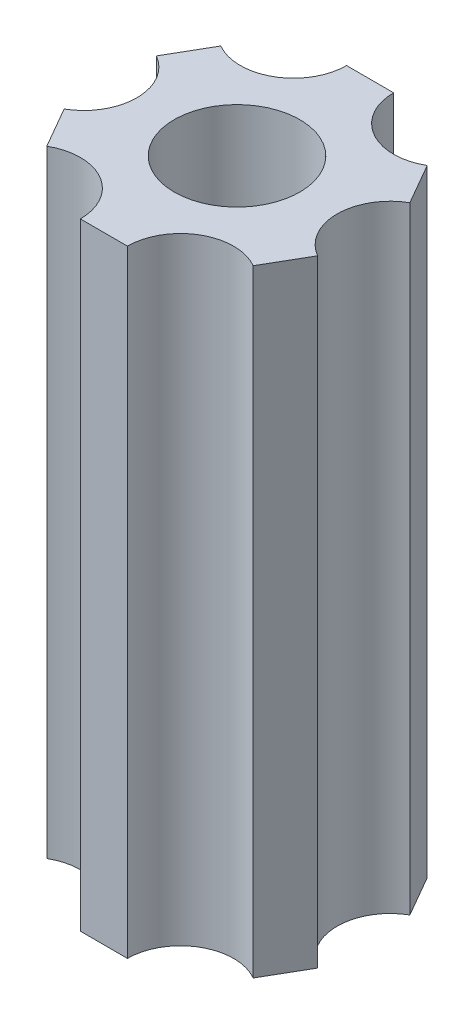
ISO-10303-21;
HEADER;
FILE_DESCRIPTION(('STEP AP214'),'2;1');
FILE_NAME('part.step','',(''),(''),'','','');
FILE_SCHEMA(('AUTOMOTIVE_DESIGN { 1 0 10303 214 1 1 1 1 }'));
ENDSEC;
DATA;
#1=APPLICATION_CONTEXT('core data for automotive mechanical design processes');
#2=APPLICATION_PROTOCOL_DEFINITION('international standard','automotive_design',2000,#1);
#3=PRODUCT_CONTEXT('',#1,'mechanical');
#4=PRODUCT('Part','Part','',(#3));
#5=PRODUCT_RELATED_PRODUCT_CATEGORY('part','',(#4));
#6=PRODUCT_DEFINITION_FORMATION('','',#4);
#7=PRODUCT_DEFINITION_CONTEXT('part definition',#1,'design');
#8=PRODUCT_DEFINITION('design','',#6,#7);
#9=PRODUCT_DEFINITION_SHAPE('','',#8);
#10=(LENGTH_UNIT() NAMED_UNIT(*) SI_UNIT(.MILLI.,.METRE.));
#11=(NAMED_UNIT(*) PLANE_ANGLE_UNIT() SI_UNIT($,.RADIAN.));
#12=(NAMED_UNIT(*) SI_UNIT($,.STERADIAN.) SOLID_ANGLE_UNIT());
#13=UNCERTAINTY_MEASURE_WITH_UNIT(LENGTH_MEASURE(1.E-05),#10,'distance_accuracy_value','');
#14=(GEOMETRIC_REPRESENTATION_CONTEXT(3) GLOBAL_UNCERTAINTY_ASSIGNED_CONTEXT((#13)) GLOBAL_UNIT_ASSIGNED_CONTEXT((#10,
#11,#12)) REPRESENTATION_CONTEXT('',''));
#15=CARTESIAN_POINT('',(0.,0.,0.));
#16=DIRECTION('',(0.,0.,1.));
#17=DIRECTION('',(1.,0.,0.));
#18=AXIS2_PLACEMENT_3D('',#15,#16,#17);
#19=CARTESIAN_POINT('',(-7.33234134065727,29.464,-0.0101881017723039));
#20=DIRECTION('',(0.,-1.,0.));
#21=DIRECTION('',(0.,0.,-1.));
#22=AXIS2_PLACEMENT_3D('',#19,#20,#21);
#23=CYLINDRICAL_SURFACE('',#22,2.54000000000018);
#24=CARTESIAN_POINT('',(-7.33234134065727,0.,-0.0101881017723039));
#25=DIRECTION('',(0.,1.,0.));
#26=DIRECTION('',(0.,0.,1.));
#27=AXIS2_PLACEMENT_3D('',#24,#25,#26);
#28=CIRCLE('',#27,2.54000000000018);
#29=CARTESIAN_POINT('',(-6.0653989971434,0.,2.19127893141545));
#30=VERTEX_POINT('',#29);
#31=CARTESIAN_POINT('',(-6.05928613608006,0.,-2.20812587297962));
#32=VERTEX_POINT('',#31);
#33=EDGE_CURVE('E164',#30,#32,#28,.T.);
#34=ORIENTED_EDGE('',*,*,#33,.F.);
#35=DIRECTION('',(0.,-1.,0.));
#36=VECTOR('',#35,1.);
#37=CARTESIAN_POINT('',(-6.0653989971434,29.464,2.19127893141545));
#38=LINE('',#37,#36);
#39=CARTESIAN_POINT('',(-6.0653989971434,29.464,2.19127893141545));
#40=VERTEX_POINT('',#39);
#41=EDGE_CURVE('E11',#40,#30,#38,.T.);
#42=ORIENTED_EDGE('',*,*,#41,.F.);
#43=CARTESIAN_POINT('',(-7.33234134065727,29.464,-0.0101881017723039));
#44=DIRECTION('',(0.,1.,0.));
#45=DIRECTION('',(0.,0.,1.));
#46=AXIS2_PLACEMENT_3D('',#43,#44,#45);
#47=CIRCLE('',#46,2.54000000000018);
#48=CARTESIAN_POINT('',(-6.05928613608006,29.464,-2.20812587297962));
#49=VERTEX_POINT('',#48);
#50=EDGE_CURVE('E208',#40,#49,#47,.T.);
#51=ORIENTED_EDGE('',*,*,#50,.T.);
#52=DIRECTION('',(0.,-1.,0.));
#53=VECTOR('',#52,1.);
#54=CARTESIAN_POINT('',(-6.05928613608006,29.464,-2.20812587297962));
#55=LINE('',#54,#53);
#56=EDGE_CURVE('E105',#49,#32,#55,.T.);
#57=ORIENTED_EDGE('',*,*,#56,.T.);
#58=EDGE_LOOP('',(#34,#42,#51,#57));
#59=FACE_BOUND('',#58,.T.);
#60=ADVANCED_FACE('F41',(#59),#23,.F.);
#61=CARTESIAN_POINT('',(-5.5036675829688,29.464,3.16735585878479));
#62=DIRECTION('',(0.866719304404536,0.,-0.498796198233825));
#63=DIRECTION('',(-0.498796198233825,0.,-0.866719304404536));
#64=AXIS2_PLACEMENT_3D('',#61,#62,#63);
#65=PLANE('',#64);
#66=DIRECTION('',(0.498796198233825,0.,0.866719304404536));
#67=VECTOR('',#66,1.);
#68=CARTESIAN_POINT('',(-5.5036675829688,0.,3.16735585878479));
#69=LINE('',#68,#67);
#70=CARTESIAN_POINT('',(-4.94193616879407,0.,4.14343278615436));
#71=VERTEX_POINT('',#70);
#72=EDGE_CURVE('E168',#30,#71,#69,.T.);
#73=ORIENTED_EDGE('',*,*,#72,.T.);
#74=DIRECTION('',(0.,-1.,0.));
#75=VECTOR('',#74,1.);
#76=CARTESIAN_POINT('',(-4.94193616879407,29.464,4.14343278615436));
#77=LINE('',#76,#75);
#78=CARTESIAN_POINT('',(-4.94193616879407,29.464,4.14343278615436));
#79=VERTEX_POINT('',#78);
#80=EDGE_CURVE('E51',#79,#71,#77,.T.);
#81=ORIENTED_EDGE('',*,*,#80,.F.);
#82=DIRECTION('',(0.498796198233825,0.,0.866719304404536));
#83=VECTOR('',#82,1.);
#84=CARTESIAN_POINT('',(-5.5036675829688,29.464,3.16735585878479));
#85=LINE('',#84,#83);
#86=EDGE_CURVE('E259',#40,#79,#85,.T.);
#87=ORIENTED_EDGE('',*,*,#86,.F.);
#88=ORIENTED_EDGE('',*,*,#41,.T.);
#89=EDGE_LOOP('',(#73,#81,#87,#88));
#90=FACE_BOUND('',#89,.T.);
#91=ADVANCED_FACE('F243',(#90),#65,.F.);
#92=CARTESIAN_POINT('',(-3.67499382527952,29.464,6.34489981934205));
#93=DIRECTION('',(0.,-1.,0.));
#94=DIRECTION('',(0.,0.,-1.));
#95=AXIS2_PLACEMENT_3D('',#92,#93,#94);
#96=CYLINDRICAL_SURFACE('',#95,2.54000000000046);
#97=CARTESIAN_POINT('',(-3.67499382527952,0.,6.34489981934205));
#98=DIRECTION('',(0.,1.,0.));
#99=DIRECTION('',(0.,0.,1.));
#100=AXIS2_PLACEMENT_3D('',#97,#98,#99);
#101=CIRCLE('',#100,2.54000000000046);
#102=CARTESIAN_POINT('',(-1.13499627718775,0.,6.34842908132257));
#103=VERTEX_POINT('',#102);
#104=EDGE_CURVE('E172',#103,#71,#101,.T.);
#105=ORIENTED_EDGE('',*,*,#104,.F.);
#106=DIRECTION('',(0.,-1.,0.));
#107=VECTOR('',#106,1.);
#108=CARTESIAN_POINT('',(-1.13499627718775,29.464,6.34842908132257));
#109=LINE('',#108,#107);
#110=CARTESIAN_POINT('',(-1.13499627718775,29.464,6.34842908132257));
#111=VERTEX_POINT('',#110);
#112=EDGE_CURVE('E230',#111,#103,#109,.T.);
#113=ORIENTED_EDGE('',*,*,#112,.F.);
#114=CARTESIAN_POINT('',(-3.67499382527952,29.464,6.34489981934205));
#115=DIRECTION('',(0.,1.,0.));
#116=DIRECTION('',(0.,0.,1.));
#117=AXIS2_PLACEMENT_3D('',#114,#115,#116);
#118=CIRCLE('',#117,2.54000000000046);
#119=EDGE_CURVE('E240',#111,#79,#118,.T.);
#120=ORIENTED_EDGE('',*,*,#119,.T.);
#121=ORIENTED_EDGE('',*,*,#80,.T.);
#122=EDGE_LOOP('',(#105,#113,#120,#121));
#123=FACE_BOUND('',#122,.T.);
#124=ADVANCED_FACE('F238',(#123),#96,.F.);
#125=CARTESIAN_POINT('',(-0.00882315495129669,29.464,6.34999387022828));
#126=DIRECTION('',(0.00138947322067664,0.,-0.999999034681619));
#127=DIRECTION('',(-0.999999034681619,0.,-0.00138947322067664));
#128=AXIS2_PLACEMENT_3D('',#125,#126,#127);
#129=PLANE('',#128);
#130=DIRECTION('',(0.999999034681619,0.,0.00138947322067664));
#131=VECTOR('',#130,1.);
#132=CARTESIAN_POINT('',(-0.00882315495129669,0.,6.34999387022828));
#133=LINE('',#132,#131);
#134=CARTESIAN_POINT('',(1.11734996728605,0.,6.35155865913399));
#135=VERTEX_POINT('',#134);
#136=EDGE_CURVE('E176',#103,#135,#133,.T.);
#137=ORIENTED_EDGE('',*,*,#136,.T.);
#138=DIRECTION('',(0.,-1.,0.));
#139=VECTOR('',#138,1.);
#140=CARTESIAN_POINT('',(1.11734996728605,29.464,6.35155865913399));
#141=LINE('',#140,#139);
#142=CARTESIAN_POINT('',(1.11734996728605,29.464,6.35155865913399));
#143=VERTEX_POINT('',#142);
#144=EDGE_CURVE('E227',#143,#135,#141,.T.);
#145=ORIENTED_EDGE('',*,*,#144,.F.);
#146=DIRECTION('',(0.999999034681619,0.,0.00138947322067664));
#147=VECTOR('',#146,1.);
#148=CARTESIAN_POINT('',(-0.00882315495129669,29.464,6.34999387022828));
#149=LINE('',#148,#147);
#150=EDGE_CURVE('E254',#111,#143,#149,.T.);
#151=ORIENTED_EDGE('',*,*,#150,.F.);
#152=ORIENTED_EDGE('',*,*,#112,.T.);
#153=EDGE_LOOP('',(#137,#145,#151,#152));
#154=FACE_BOUND('',#153,.T.);
#155=ADVANCED_FACE('F251',(#154),#129,.F.);
#156=CARTESIAN_POINT('',(3.65734751537801,29.464,6.3550879211142));
#157=DIRECTION('',(0.,-1.,0.));
#158=DIRECTION('',(0.,0.,-1.));
#159=AXIS2_PLACEMENT_3D('',#156,#157,#158);
#160=CYLINDRICAL_SURFACE('',#159,2.54000000000066);
#161=CARTESIAN_POINT('',(3.65734751537801,0.,6.3550879211142));
#162=DIRECTION('',(0.,1.,0.));
#163=DIRECTION('',(0.,0.,1.));
#164=AXIS2_PLACEMENT_3D('',#161,#162,#163);
#165=CIRCLE('',#164,2.54000000000066);
#166=CARTESIAN_POINT('',(4.93040271995547,0.,4.15715014990647));
#167=VERTEX_POINT('',#166);
#168=EDGE_CURVE('E180',#167,#135,#165,.T.);
#169=ORIENTED_EDGE('',*,*,#168,.F.);
#170=DIRECTION('',(0.,-1.,0.));
#171=VECTOR('',#170,1.);
#172=CARTESIAN_POINT('',(4.93040271995547,29.464,4.15715014990647));
#173=LINE('',#172,#171);
#174=CARTESIAN_POINT('',(4.93040271995547,29.464,4.15715014990647));
#175=VERTEX_POINT('',#174);
#176=EDGE_CURVE('E224',#175,#167,#173,.T.);
#177=ORIENTED_EDGE('',*,*,#176,.F.);
#178=CARTESIAN_POINT('',(3.65734751537801,29.464,6.3550879211142));
#179=DIRECTION('',(0.,1.,0.));
#180=DIRECTION('',(0.,0.,1.));
#181=AXIS2_PLACEMENT_3D('',#178,#179,#180);
#182=CIRCLE('',#181,2.54000000000066);
#183=EDGE_CURVE('E257',#175,#143,#182,.T.);
#184=ORIENTED_EDGE('',*,*,#183,.T.);
#185=ORIENTED_EDGE('',*,*,#144,.T.);
#186=EDGE_LOOP('',(#169,#177,#184,#185));
#187=FACE_BOUND('',#186,.T.);
#188=ADVANCED_FACE('F315',(#187),#160,.F.);
#189=CARTESIAN_POINT('',(5.4948444280175,29.464,3.18263801144348));
#190=DIRECTION('',(-0.86532983118386,0.,-0.501202836447793));
#191=DIRECTION('',(-0.501202836447793,0.,0.86532983118386));
#192=AXIS2_PLACEMENT_3D('',#189,#190,#191);
#193=PLANE('',#192);
#194=DIRECTION('',(0.501202836447793,0.,-0.86532983118386));
#195=VECTOR('',#194,1.);
#196=CARTESIAN_POINT('',(5.4948444280175,0.,3.18263801144348));
#197=LINE('',#196,#195);
#198=CARTESIAN_POINT('',(6.05928613608014,0.,2.20812587297947));
#199=VERTEX_POINT('',#198);
#200=EDGE_CURVE('E184',#167,#199,#197,.T.);
#201=ORIENTED_EDGE('',*,*,#200,.T.);
#202=DIRECTION('',(0.,-1.,0.));
#203=VECTOR('',#202,1.);
#204=CARTESIAN_POINT('',(6.05928613608014,29.464,2.20812587297947));
#205=LINE('',#204,#203);
#206=CARTESIAN_POINT('',(6.05928613608014,29.464,2.20812587297947));
#207=VERTEX_POINT('',#206);
#208=EDGE_CURVE('E221',#207,#199,#205,.T.);
#209=ORIENTED_EDGE('',*,*,#208,.F.);
#210=DIRECTION('',(0.501202836447793,0.,-0.86532983118386));
#211=VECTOR('',#210,1.);
#212=CARTESIAN_POINT('',(5.4948444280175,29.464,3.18263801144348));
#213=LINE('',#212,#211);
#214=EDGE_CURVE('E268',#175,#207,#213,.T.);
#215=ORIENTED_EDGE('',*,*,#214,.F.);
#216=ORIENTED_EDGE('',*,*,#176,.T.);
#217=EDGE_LOOP('',(#201,#209,#215,#216));
#218=FACE_BOUND('',#217,.T.);
#219=ADVANCED_FACE('F318',(#218),#193,.F.);
#220=CARTESIAN_POINT('',(7.33234134065781,29.464,0.0101881017719942));
#221=DIRECTION('',(0.,-1.,0.));
#222=DIRECTION('',(0.,0.,-1.));
#223=AXIS2_PLACEMENT_3D('',#220,#221,#222);
#224=CYLINDRICAL_SURFACE('',#223,2.54000000000055);
#225=CARTESIAN_POINT('',(7.33234134065781,0.,0.0101881017719942));
#226=DIRECTION('',(0.,1.,0.));
#227=DIRECTION('',(0.,0.,1.));
#228=AXIS2_PLACEMENT_3D('',#225,#226,#227);
#229=CIRCLE('',#228,2.54000000000055);
#230=CARTESIAN_POINT('',(6.06539899714321,0.,-2.19127893141577));
#231=VERTEX_POINT('',#230);
#232=EDGE_CURVE('E188',#231,#199,#229,.T.);
#233=ORIENTED_EDGE('',*,*,#232,.F.);
#234=DIRECTION('',(0.,-1.,0.));
#235=VECTOR('',#234,1.);
#236=CARTESIAN_POINT('',(6.06539899714321,29.464,-2.19127893141577));
#237=LINE('',#236,#235);
#238=CARTESIAN_POINT('',(6.06539899714321,29.464,-2.19127893141577));
#239=VERTEX_POINT('',#238);
#240=EDGE_CURVE('E218',#239,#231,#237,.T.);
#241=ORIENTED_EDGE('',*,*,#240,.F.);
#242=CARTESIAN_POINT('',(7.33234134065781,29.464,0.0101881017719942));
#243=DIRECTION('',(0.,1.,0.));
#244=DIRECTION('',(0.,0.,1.));
#245=AXIS2_PLACEMENT_3D('',#242,#243,#244);
#246=CIRCLE('',#245,2.54000000000055);
#247=EDGE_CURVE('E271',#239,#207,#246,.T.);
#248=ORIENTED_EDGE('',*,*,#247,.T.);
#249=ORIENTED_EDGE('',*,*,#208,.T.);
#250=EDGE_LOOP('',(#233,#241,#248,#249));
#251=FACE_BOUND('',#250,.T.);
#252=ADVANCED_FACE('F322',(#251),#224,.F.);
#253=CARTESIAN_POINT('',(5.5036675829688,29.464,-3.16735585878479));
#254=DIRECTION('',(-0.866719304404536,0.,0.498796198233825));
#255=DIRECTION('',(0.498796198233826,0.,0.866719304404536));
#256=AXIS2_PLACEMENT_3D('',#253,#254,#255);
#257=PLANE('',#256);
#258=DIRECTION('',(-0.498796198233826,0.,-0.866719304404536));
#259=VECTOR('',#258,1.);
#260=CARTESIAN_POINT('',(5.5036675829688,0.,-3.16735585878479));
#261=LINE('',#260,#259);
#262=CARTESIAN_POINT('',(4.94193616879396,0.,-4.14343278615456));
#263=VERTEX_POINT('',#262);
#264=EDGE_CURVE('E192',#231,#263,#261,.T.);
#265=ORIENTED_EDGE('',*,*,#264,.T.);
#266=DIRECTION('',(0.,-1.,0.));
#267=VECTOR('',#266,1.);
#268=CARTESIAN_POINT('',(4.94193616879396,29.464,-4.14343278615456));
#269=LINE('',#268,#267);
#270=CARTESIAN_POINT('',(4.94193616879396,29.464,-4.14343278615456));
#271=VERTEX_POINT('',#270);
#272=EDGE_CURVE('E215',#271,#263,#269,.T.);
#273=ORIENTED_EDGE('',*,*,#272,.F.);
#274=DIRECTION('',(-0.498796198233826,0.,-0.866719304404536));
#275=VECTOR('',#274,1.);
#276=CARTESIAN_POINT('',(5.5036675829688,29.464,-3.16735585878479));
#277=LINE('',#276,#275);
#278=EDGE_CURVE('E275',#239,#271,#277,.T.);
#279=ORIENTED_EDGE('',*,*,#278,.F.);
#280=ORIENTED_EDGE('',*,*,#240,.T.);
#281=EDGE_LOOP('',(#265,#273,#279,#280));
#282=FACE_BOUND('',#281,.T.);
#283=ADVANCED_FACE('F326',(#282),#257,.F.);
#284=CARTESIAN_POINT('',(3.67499382528006,29.464,-6.34489981934236));
#285=DIRECTION('',(0.,-1.,0.));
#286=DIRECTION('',(0.,0.,-1.));
#287=AXIS2_PLACEMENT_3D('',#284,#285,#286);
#288=CYLINDRICAL_SURFACE('',#287,2.54000000000023);
#289=CARTESIAN_POINT('',(3.67499382528006,0.,-6.34489981934236));
#290=DIRECTION('',(0.,1.,0.));
#291=DIRECTION('',(0.,0.,1.));
#292=AXIS2_PLACEMENT_3D('',#289,#290,#291);
#293=CIRCLE('',#292,2.54000000000023);
#294=CARTESIAN_POINT('',(1.13499627718852,0.,-6.34842908132257));
#295=VERTEX_POINT('',#294);
#296=EDGE_CURVE('E196',#295,#263,#293,.T.);
#297=ORIENTED_EDGE('',*,*,#296,.F.);
#298=DIRECTION('',(0.,-1.,0.));
#299=VECTOR('',#298,1.);
#300=CARTESIAN_POINT('',(1.13499627718852,29.464,-6.34842908132257));
#301=LINE('',#300,#299);
#302=CARTESIAN_POINT('',(1.13499627718852,29.464,-6.34842908132257));
#303=VERTEX_POINT('',#302);
#304=EDGE_CURVE('E155',#303,#295,#301,.T.);
#305=ORIENTED_EDGE('',*,*,#304,.F.);
#306=CARTESIAN_POINT('',(3.67499382528006,29.464,-6.34489981934236));
#307=DIRECTION('',(0.,1.,0.));
#308=DIRECTION('',(0.,0.,1.));
#309=AXIS2_PLACEMENT_3D('',#306,#307,#308);
#310=CIRCLE('',#309,2.54000000000023);
#311=EDGE_CURVE('E142',#303,#271,#310,.T.);
#312=ORIENTED_EDGE('',*,*,#311,.T.);
#313=ORIENTED_EDGE('',*,*,#272,.T.);
#314=EDGE_LOOP('',(#297,#305,#312,#313));
#315=FACE_BOUND('',#314,.T.);
#316=ADVANCED_FACE('F280',(#315),#288,.F.);
#317=CARTESIAN_POINT('',(0.00882315495129593,29.464,-6.34999387022828));
#318=DIRECTION('',(-0.00138947322067653,0.,0.999999034681619));
#319=DIRECTION('',(0.999999034681619,0.,0.00138947322067653));
#320=AXIS2_PLACEMENT_3D('',#317,#318,#319);
#321=PLANE('',#320);
#322=DIRECTION('',(-0.999999034681619,0.,-0.00138947322067653));
#323=VECTOR('',#322,1.);
#324=CARTESIAN_POINT('',(0.00882315495129593,0.,-6.34999387022828));
#325=LINE('',#324,#323);
#326=CARTESIAN_POINT('',(-1.11734996728617,0.,-6.35155865913399));
#327=VERTEX_POINT('',#326);
#328=EDGE_CURVE('E150',#295,#327,#325,.T.);
#329=ORIENTED_EDGE('',*,*,#328,.T.);
#330=DIRECTION('',(0.,-1.,0.));
#331=VECTOR('',#330,1.);
#332=CARTESIAN_POINT('',(-1.11734996728617,29.464,-6.35155865913399));
#333=LINE('',#332,#331);
#334=CARTESIAN_POINT('',(-1.11734996728617,29.464,-6.35155865913399));
#335=VERTEX_POINT('',#334);
#336=EDGE_CURVE('E147',#335,#327,#333,.T.);
#337=ORIENTED_EDGE('',*,*,#336,.F.);
#338=DIRECTION('',(-0.999999034681619,0.,-0.00138947322067653));
#339=VECTOR('',#338,1.);
#340=CARTESIAN_POINT('',(0.00882315495129593,29.464,-6.34999387022828));
#341=LINE('',#340,#339);
#342=EDGE_CURVE('E136',#303,#335,#341,.T.);
#343=ORIENTED_EDGE('',*,*,#342,.F.);
#344=ORIENTED_EDGE('',*,*,#304,.T.);
#345=EDGE_LOOP('',(#329,#337,#343,#344));
#346=FACE_BOUND('',#345,.T.);
#347=ADVANCED_FACE('F148',(#346),#321,.F.);
#348=CARTESIAN_POINT('',(-3.65734751537748,29.464,-6.35508792111451));
#349=DIRECTION('',(0.,-1.,0.));
#350=DIRECTION('',(0.,0.,-1.));
#351=AXIS2_PLACEMENT_3D('',#348,#349,#350);
#352=CYLINDRICAL_SURFACE('',#351,2.54);
#353=CARTESIAN_POINT('',(-3.65734751537748,0.,-6.35508792111451));
#354=DIRECTION('',(0.,1.,0.));
#355=DIRECTION('',(0.,0.,1.));
#356=AXIS2_PLACEMENT_3D('',#353,#354,#355);
#357=CIRCLE('',#356,2.54);
#358=CARTESIAN_POINT('',(-4.93040271995487,0.,-4.15715014990751));
#359=VERTEX_POINT('',#358);
#360=EDGE_CURVE('E202',#359,#327,#357,.T.);
#361=ORIENTED_EDGE('',*,*,#360,.F.);
#362=DIRECTION('',(0.,-1.,0.));
#363=VECTOR('',#362,1.);
#364=CARTESIAN_POINT('',(-4.93040271995487,29.464,-4.15715014990751));
#365=LINE('',#364,#363);
#366=CARTESIAN_POINT('',(-4.93040271995487,29.464,-4.15715014990751));
#367=VERTEX_POINT('',#366);
#368=EDGE_CURVE('E98',#367,#359,#365,.T.);
#369=ORIENTED_EDGE('',*,*,#368,.F.);
#370=CARTESIAN_POINT('',(-3.65734751537748,29.464,-6.35508792111451));
#371=DIRECTION('',(0.,1.,0.));
#372=DIRECTION('',(0.,0.,1.));
#373=AXIS2_PLACEMENT_3D('',#370,#371,#372);
#374=CIRCLE('',#373,2.54);
#375=EDGE_CURVE('E140',#367,#335,#374,.T.);
#376=ORIENTED_EDGE('',*,*,#375,.T.);
#377=ORIENTED_EDGE('',*,*,#336,.T.);
#378=EDGE_LOOP('',(#361,#369,#376,#377));
#379=FACE_BOUND('',#378,.T.);
#380=ADVANCED_FACE('F157',(#379),#352,.F.);
#381=CARTESIAN_POINT('',(-5.49484442801751,29.464,-3.18263801144349));
#382=DIRECTION('',(0.86532983118386,0.,0.501202836447793));
#383=DIRECTION('',(0.501202836447793,0.,-0.86532983118386));
#384=AXIS2_PLACEMENT_3D('',#381,#382,#383);
#385=PLANE('',#384);
#386=DIRECTION('',(-0.501202836447793,0.,0.86532983118386));
#387=VECTOR('',#386,1.);
#388=CARTESIAN_POINT('',(-5.49484442801751,0.,-3.18263801144349));
#389=LINE('',#388,#387);
#390=EDGE_CURVE('E205',#359,#32,#389,.T.);
#391=ORIENTED_EDGE('',*,*,#390,.T.);
#392=ORIENTED_EDGE('',*,*,#56,.F.);
#393=DIRECTION('',(-0.501202836447793,0.,0.86532983118386));
#394=VECTOR('',#393,1.);
#395=CARTESIAN_POINT('',(-5.49484442801751,29.464,-3.18263801144349));
#396=LINE('',#395,#394);
#397=EDGE_CURVE('E59',#367,#49,#396,.T.);
#398=ORIENTED_EDGE('',*,*,#397,.F.);
#399=ORIENTED_EDGE('',*,*,#368,.T.);
#400=EDGE_LOOP('',(#391,#392,#398,#399));
#401=FACE_BOUND('',#400,.T.);
#402=ADVANCED_FACE('F283',(#401),#385,.F.);
#403=CARTESIAN_POINT('',(0.,29.464,0.));
#404=DIRECTION('',(0.,1.,0.));
#405=DIRECTION('',(0.,0.,1.));
#406=AXIS2_PLACEMENT_3D('',#403,#404,#405);
#407=PLANE('',#406);
#408=CARTESIAN_POINT('',(0.,29.464,0.));
#409=DIRECTION('',(0.,1.,0.));
#410=DIRECTION('',(0.,0.,1.));
#411=AXIS2_PLACEMENT_3D('',#408,#409,#410);
#412=CIRCLE('',#411,3.);
#413=CARTESIAN_POINT('',(0.,29.464,3.));
#414=VERTEX_POINT('',#413);
#415=EDGE_CURVE('E286',#414,#414,#412,.T.);
#416=ORIENTED_EDGE('',*,*,#415,.F.);
#417=EDGE_LOOP('',(#416));
#418=FACE_BOUND('',#417,.T.);
#419=ORIENTED_EDGE('',*,*,#50,.F.);
#420=ORIENTED_EDGE('',*,*,#86,.T.);
#421=ORIENTED_EDGE('',*,*,#119,.F.);
#422=ORIENTED_EDGE('',*,*,#150,.T.);
#423=ORIENTED_EDGE('',*,*,#183,.F.);
#424=ORIENTED_EDGE('',*,*,#214,.T.);
#425=ORIENTED_EDGE('',*,*,#247,.F.);
#426=ORIENTED_EDGE('',*,*,#278,.T.);
#427=ORIENTED_EDGE('',*,*,#311,.F.);
#428=ORIENTED_EDGE('',*,*,#342,.T.);
#429=ORIENTED_EDGE('',*,*,#375,.F.);
#430=ORIENTED_EDGE('',*,*,#397,.T.);
#431=EDGE_LOOP('',(#419,#420,#421,#422,#423,#424,#425,#426,#427,#428,#429,#430));
#432=FACE_BOUND('',#431,.T.);
#433=ADVANCED_FACE('F138',(#418,#432),#407,.T.);
#434=CARTESIAN_POINT('',(0.,0.,0.));
#435=DIRECTION('',(0.,1.,0.));
#436=DIRECTION('',(0.,0.,1.));
#437=AXIS2_PLACEMENT_3D('',#434,#435,#436);
#438=PLANE('',#437);
#439=CARTESIAN_POINT('',(0.,0.,0.));
#440=DIRECTION('',(0.,1.,0.));
#441=DIRECTION('',(0.,0.,1.));
#442=AXIS2_PLACEMENT_3D('',#439,#440,#441);
#443=CIRCLE('',#442,3.);
#444=CARTESIAN_POINT('',(0.,0.,3.));
#445=VERTEX_POINT('',#444);
#446=EDGE_CURVE('E44',#445,#445,#443,.T.);
#447=ORIENTED_EDGE('',*,*,#446,.T.);
#448=EDGE_LOOP('',(#447));
#449=FACE_BOUND('',#448,.T.);
#450=ORIENTED_EDGE('',*,*,#33,.T.);
#451=ORIENTED_EDGE('',*,*,#390,.F.);
#452=ORIENTED_EDGE('',*,*,#360,.T.);
#453=ORIENTED_EDGE('',*,*,#328,.F.);
#454=ORIENTED_EDGE('',*,*,#296,.T.);
#455=ORIENTED_EDGE('',*,*,#264,.F.);
#456=ORIENTED_EDGE('',*,*,#232,.T.);
#457=ORIENTED_EDGE('',*,*,#200,.F.);
#458=ORIENTED_EDGE('',*,*,#168,.T.);
#459=ORIENTED_EDGE('',*,*,#136,.F.);
#460=ORIENTED_EDGE('',*,*,#104,.T.);
#461=ORIENTED_EDGE('',*,*,#72,.F.);
#462=EDGE_LOOP('',(#450,#451,#452,#453,#454,#455,#456,#457,#458,#459,#460,#461));
#463=FACE_BOUND('',#462,.T.);
#464=ADVANCED_FACE('F246',(#449,#463),#438,.F.);
#465=CARTESIAN_POINT('',(0.,-224.536,0.));
#466=DIRECTION('',(0.,1.,0.));
#467=DIRECTION('',(0.,0.,1.));
#468=AXIS2_PLACEMENT_3D('',#465,#466,#467);
#469=CYLINDRICAL_SURFACE('',#468,3.);
#470=ORIENTED_EDGE('',*,*,#415,.T.);
#471=EDGE_LOOP('',(#470));
#472=FACE_BOUND('',#471,.T.);
#473=ORIENTED_EDGE('',*,*,#446,.F.);
#474=EDGE_LOOP('',(#473));
#475=FACE_BOUND('',#474,.T.);
#476=ADVANCED_FACE('F296',(#472,#475),#469,.F.);
#477=CLOSED_SHELL('',(#60,#91,#124,#155,#188,#219,#252,#283,#316,#347,#380,#402,#433,#464,#476));
#478=MANIFOLD_SOLID_BREP('B2',#477);
#479=ADVANCED_BREP_SHAPE_REPRESENTATION('',(#18,#478),#14);
#480=SHAPE_DEFINITION_REPRESENTATION(#9,#479);
ENDSEC;
END-ISO-10303-21;
